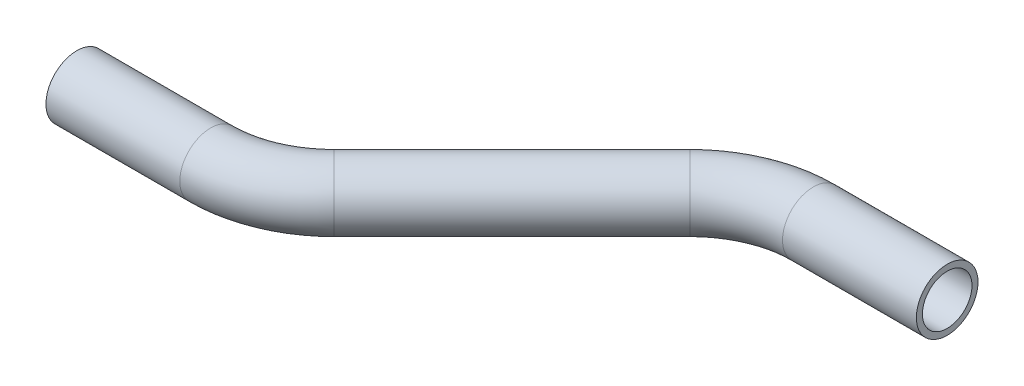
ISO-10303-21;
HEADER;
FILE_DESCRIPTION(('STEP AP214'),'2;1');
FILE_NAME('part.step','',(''),(''),'','','');
FILE_SCHEMA(('AUTOMOTIVE_DESIGN { 1 0 10303 214 1 1 1 1 }'));
ENDSEC;
DATA;
#1=APPLICATION_CONTEXT('core data for automotive mechanical design processes');
#2=APPLICATION_PROTOCOL_DEFINITION('international standard','automotive_design',2000,#1);
#3=PRODUCT_CONTEXT('',#1,'mechanical');
#4=PRODUCT('Part','Part','',(#3));
#5=PRODUCT_RELATED_PRODUCT_CATEGORY('part','',(#4));
#6=PRODUCT_DEFINITION_FORMATION('','',#4);
#7=PRODUCT_DEFINITION_CONTEXT('part definition',#1,'design');
#8=PRODUCT_DEFINITION('design','',#6,#7);
#9=PRODUCT_DEFINITION_SHAPE('','',#8);
#10=(LENGTH_UNIT() NAMED_UNIT(*) SI_UNIT(.MILLI.,.METRE.));
#11=(NAMED_UNIT(*) PLANE_ANGLE_UNIT() SI_UNIT($,.RADIAN.));
#12=(NAMED_UNIT(*) SI_UNIT($,.STERADIAN.) SOLID_ANGLE_UNIT());
#13=UNCERTAINTY_MEASURE_WITH_UNIT(LENGTH_MEASURE(1.E-05),#10,'distance_accuracy_value','');
#14=(GEOMETRIC_REPRESENTATION_CONTEXT(3) GLOBAL_UNCERTAINTY_ASSIGNED_CONTEXT((#13)) GLOBAL_UNIT_ASSIGNED_CONTEXT((#10,
#11,#12)) REPRESENTATION_CONTEXT('',''));
#15=CARTESIAN_POINT('',(0.,0.,0.));
#16=DIRECTION('',(0.,0.,1.));
#17=DIRECTION('',(1.,0.,0.));
#18=AXIS2_PLACEMENT_3D('',#15,#16,#17);
#19=CARTESIAN_POINT('',(0.,0.,0.));
#20=DIRECTION('',(1.,0.,0.));
#21=DIRECTION('',(0.,0.,-1.));
#22=AXIS2_PLACEMENT_3D('',#19,#20,#21);
#23=CYLINDRICAL_SURFACE('',#22,6.35);
#24=CARTESIAN_POINT('',(27.5789755157234,0.,0.));
#25=DIRECTION('',(1.,0.,0.));
#26=DIRECTION('',(0.,0.,-1.));
#27=AXIS2_PLACEMENT_3D('',#24,#25,#26);
#28=CIRCLE('',#27,6.35);
#29=CARTESIAN_POINT('',(27.5789755157234,0.,6.34999999999999));
#30=VERTEX_POINT('',#29);
#31=EDGE_CURVE('E61',#30,#30,#28,.T.);
#32=ORIENTED_EDGE('',*,*,#31,.F.);
#33=EDGE_LOOP('',(#32));
#34=FACE_BOUND('',#33,.T.);
#35=CARTESIAN_POINT('',(0.,0.,0.));
#36=DIRECTION('',(1.,0.,0.));
#37=DIRECTION('',(0.,0.,-1.));
#38=AXIS2_PLACEMENT_3D('',#35,#36,#37);
#39=CIRCLE('',#38,6.35);
#40=CARTESIAN_POINT('',(0.,0.,-6.35));
#41=VERTEX_POINT('',#40);
#42=EDGE_CURVE('E58',#41,#41,#39,.T.);
#43=ORIENTED_EDGE('',*,*,#42,.T.);
#44=EDGE_LOOP('',(#43));
#45=FACE_BOUND('',#44,.T.);
#46=ADVANCED_FACE('F37',(#34,#45),#23,.T.);
#47=CARTESIAN_POINT('',(27.5789755157234,0.,-25.4));
#48=DIRECTION('',(0.,1.,0.));
#49=DIRECTION('',(0.,0.,1.));
#50=AXIS2_PLACEMENT_3D('',#47,#48,#49);
#51=TOROIDAL_SURFACE('',#50,25.4,6.35);
#52=CARTESIAN_POINT('',(45.5394877578617,0.,-7.43948775786173));
#53=DIRECTION('',(0.707106781186546,0.,-0.707106781186549));
#54=DIRECTION('',(-0.707106781186549,0.,-0.707106781186546));
#55=AXIS2_PLACEMENT_3D('',#52,#53,#54);
#56=CIRCLE('',#55,6.35);
#57=CARTESIAN_POINT('',(50.0296158183963,0.,-2.94935969732716));
#58=VERTEX_POINT('',#57);
#59=EDGE_CURVE('E64',#58,#58,#56,.T.);
#60=CARTESIAN_POINT('',(27.5789755157234,0.,-25.4));
#61=DIRECTION('',(0.,1.,0.));
#62=DIRECTION('',(0.,0.,1.));
#63=AXIS2_PLACEMENT_3D('',#60,#61,#62);
#64=CIRCLE('',#63,31.75);
#65=EDGE_CURVE('',#30,#58,#64,.T.);
#66=ORIENTED_EDGE('',*,*,#31,.T.);
#67=ORIENTED_EDGE('',*,*,#59,.F.);
#68=ORIENTED_EDGE('',*,*,#65,.T.);
#69=ORIENTED_EDGE('',*,*,#65,.F.);
#70=EDGE_LOOP('',(#66,#68,#67,#69));
#71=FACE_BOUND('',#70,.T.);
#72=ADVANCED_FACE('F83',(#71),#51,.T.);
#73=CARTESIAN_POINT('',(45.5394877578617,0.,-7.43948775786173));
#74=DIRECTION('',(0.707106781186546,0.,-0.707106781186548));
#75=DIRECTION('',(-0.707106781186549,0.,-0.707106781186547));
#76=AXIS2_PLACEMENT_3D('',#73,#74,#75);
#77=CYLINDRICAL_SURFACE('',#76,6.35);
#78=CARTESIAN_POINT('',(82.2225122421381,0.,-44.1225122421382));
#79=DIRECTION('',(0.707106781186547,0.,-0.707106781186549));
#80=DIRECTION('',(-0.707106781186549,0.,-0.707106781186547));
#81=AXIS2_PLACEMENT_3D('',#78,#79,#80);
#82=CIRCLE('',#81,6.35);
#83=CARTESIAN_POINT('',(77.7323841816035,0.,-48.6126403026728));
#84=VERTEX_POINT('',#83);
#85=EDGE_CURVE('E66',#84,#84,#82,.T.);
#86=ORIENTED_EDGE('',*,*,#85,.F.);
#87=EDGE_LOOP('',(#86));
#88=FACE_BOUND('',#87,.T.);
#89=ORIENTED_EDGE('',*,*,#59,.T.);
#90=EDGE_LOOP('',(#89));
#91=FACE_BOUND('',#90,.T.);
#92=ADVANCED_FACE('F76',(#88,#91),#77,.T.);
#93=CARTESIAN_POINT('',(100.183024484276,0.,-26.162));
#94=DIRECTION('',(0.,-1.,0.));
#95=DIRECTION('',(0.,0.,-1.));
#96=AXIS2_PLACEMENT_3D('',#93,#94,#95);
#97=TOROIDAL_SURFACE('',#96,25.4,6.35);
#98=CARTESIAN_POINT('',(100.183024484276,0.,-51.562));
#99=DIRECTION('',(1.,0.,0.));
#100=DIRECTION('',(0.,0.,-1.));
#101=AXIS2_PLACEMENT_3D('',#98,#99,#100);
#102=CIRCLE('',#101,6.35);
#103=CARTESIAN_POINT('',(100.183024484276,0.,-57.912));
#104=VERTEX_POINT('',#103);
#105=EDGE_CURVE('E41',#104,#104,#102,.T.);
#106=CARTESIAN_POINT('',(100.183024484276,0.,-26.162));
#107=DIRECTION('',(0.,-1.,0.));
#108=DIRECTION('',(0.,0.,-1.));
#109=AXIS2_PLACEMENT_3D('',#106,#107,#108);
#110=CIRCLE('',#109,31.75);
#111=EDGE_CURVE('',#84,#104,#110,.T.);
#112=ORIENTED_EDGE('',*,*,#85,.T.);
#113=ORIENTED_EDGE('',*,*,#105,.F.);
#114=ORIENTED_EDGE('',*,*,#111,.T.);
#115=ORIENTED_EDGE('',*,*,#111,.F.);
#116=EDGE_LOOP('',(#112,#114,#113,#115));
#117=FACE_BOUND('',#116,.T.);
#118=ADVANCED_FACE('F74',(#117),#97,.T.);
#119=CARTESIAN_POINT('',(100.183024484276,0.,-51.562));
#120=DIRECTION('',(1.,0.,0.));
#121=DIRECTION('',(0.,0.,-1.));
#122=AXIS2_PLACEMENT_3D('',#119,#120,#121);
#123=CYLINDRICAL_SURFACE('',#122,6.35);
#124=CARTESIAN_POINT('',(127.762,0.,-51.562));
#125=DIRECTION('',(1.,0.,0.));
#126=DIRECTION('',(0.,0.,-1.));
#127=AXIS2_PLACEMENT_3D('',#124,#125,#126);
#128=CIRCLE('',#127,6.35);
#129=CARTESIAN_POINT('',(127.762,0.,-57.912));
#130=VERTEX_POINT('',#129);
#131=EDGE_CURVE('E54',#130,#130,#128,.T.);
#132=ORIENTED_EDGE('',*,*,#131,.F.);
#133=EDGE_LOOP('',(#132));
#134=FACE_BOUND('',#133,.T.);
#135=ORIENTED_EDGE('',*,*,#105,.T.);
#136=EDGE_LOOP('',(#135));
#137=FACE_BOUND('',#136,.T.);
#138=ADVANCED_FACE('F39',(#134,#137),#123,.T.);
#139=CARTESIAN_POINT('',(0.,0.,0.));
#140=DIRECTION('',(1.,0.,0.));
#141=DIRECTION('',(0.,0.,-1.));
#142=AXIS2_PLACEMENT_3D('',#139,#140,#141);
#143=PLANE('',#142);
#144=CARTESIAN_POINT('',(0.,0.,0.));
#145=DIRECTION('',(1.,0.,0.));
#146=DIRECTION('',(0.,0.,-1.));
#147=AXIS2_PLACEMENT_3D('',#144,#145,#146);
#148=CIRCLE('',#147,5.1054);
#149=CARTESIAN_POINT('',(0.,0.,-5.1054));
#150=VERTEX_POINT('',#149);
#151=EDGE_CURVE('E57',#150,#150,#148,.F.);
#152=ORIENTED_EDGE('',*,*,#151,.F.);
#153=EDGE_LOOP('',(#152));
#154=FACE_BOUND('',#153,.T.);
#155=ORIENTED_EDGE('',*,*,#42,.F.);
#156=EDGE_LOOP('',(#155));
#157=FACE_BOUND('',#156,.T.);
#158=ADVANCED_FACE('F81',(#154,#157),#143,.F.);
#159=CARTESIAN_POINT('',(127.762,0.,-51.562));
#160=DIRECTION('',(1.,0.,0.));
#161=DIRECTION('',(0.,0.,-1.));
#162=AXIS2_PLACEMENT_3D('',#159,#160,#161);
#163=PLANE('',#162);
#164=CARTESIAN_POINT('',(127.762,0.,-51.562));
#165=DIRECTION('',(1.,0.,0.));
#166=DIRECTION('',(0.,0.,-1.));
#167=AXIS2_PLACEMENT_3D('',#164,#165,#166);
#168=CIRCLE('',#167,5.1054);
#169=CARTESIAN_POINT('',(127.762,0.,-56.6674));
#170=VERTEX_POINT('',#169);
#171=EDGE_CURVE('E10',#170,#170,#168,.F.);
#172=ORIENTED_EDGE('',*,*,#171,.T.);
#173=EDGE_LOOP('',(#172));
#174=FACE_BOUND('',#173,.T.);
#175=ORIENTED_EDGE('',*,*,#131,.T.);
#176=EDGE_LOOP('',(#175));
#177=FACE_BOUND('',#176,.T.);
#178=ADVANCED_FACE('F100',(#174,#177),#163,.T.);
#179=CARTESIAN_POINT('',(0.,0.,0.));
#180=DIRECTION('',(1.,0.,0.));
#181=DIRECTION('',(0.,0.,-1.));
#182=AXIS2_PLACEMENT_3D('',#179,#180,#181);
#183=CYLINDRICAL_SURFACE('',#182,5.1054);
#184=CARTESIAN_POINT('',(27.5789755157234,0.,0.));
#185=DIRECTION('',(1.,0.,0.));
#186=DIRECTION('',(0.,0.,-1.));
#187=AXIS2_PLACEMENT_3D('',#184,#185,#186);
#188=CIRCLE('',#187,5.1054);
#189=CARTESIAN_POINT('',(27.5789755157234,0.,5.1054));
#190=VERTEX_POINT('',#189);
#191=EDGE_CURVE('E197',#190,#190,#188,.F.);
#192=ORIENTED_EDGE('',*,*,#191,.F.);
#193=EDGE_LOOP('',(#192));
#194=FACE_BOUND('',#193,.T.);
#195=ORIENTED_EDGE('',*,*,#151,.T.);
#196=EDGE_LOOP('',(#195));
#197=FACE_BOUND('',#196,.T.);
#198=ADVANCED_FACE('F103',(#194,#197),#183,.F.);
#199=CARTESIAN_POINT('',(27.5789755157234,0.,-25.4));
#200=DIRECTION('',(0.,1.,0.));
#201=DIRECTION('',(0.,0.,1.));
#202=AXIS2_PLACEMENT_3D('',#199,#200,#201);
#203=TOROIDAL_SURFACE('',#202,25.4,5.1054);
#204=CARTESIAN_POINT('',(45.5394877578617,0.,-7.43948775786173));
#205=DIRECTION('',(0.707106781186546,0.,-0.707106781186549));
#206=DIRECTION('',(-0.707106781186549,0.,-0.707106781186546));
#207=AXIS2_PLACEMENT_3D('',#204,#205,#206);
#208=CIRCLE('',#207,5.1054);
#209=CARTESIAN_POINT('',(49.1495507185315,0.,-3.82942479719193));
#210=VERTEX_POINT('',#209);
#211=EDGE_CURVE('E196',#210,#210,#208,.F.);
#212=CARTESIAN_POINT('',(27.5789755157234,0.,-25.4));
#213=DIRECTION('',(0.,1.,0.));
#214=DIRECTION('',(0.,0.,1.));
#215=AXIS2_PLACEMENT_3D('',#212,#213,#214);
#216=CIRCLE('',#215,30.5054);
#217=EDGE_CURVE('',#190,#210,#216,.T.);
#218=ORIENTED_EDGE('',*,*,#191,.T.);
#219=ORIENTED_EDGE('',*,*,#211,.F.);
#220=ORIENTED_EDGE('',*,*,#217,.T.);
#221=ORIENTED_EDGE('',*,*,#217,.F.);
#222=EDGE_LOOP('',(#218,#220,#219,#221));
#223=FACE_BOUND('',#222,.T.);
#224=ADVANCED_FACE('F159',(#223),#203,.F.);
#225=CARTESIAN_POINT('',(45.5394877578617,0.,-7.43948775786173));
#226=DIRECTION('',(0.707106781186546,0.,-0.707106781186548));
#227=DIRECTION('',(-0.707106781186549,0.,-0.707106781186547));
#228=AXIS2_PLACEMENT_3D('',#225,#226,#227);
#229=CYLINDRICAL_SURFACE('',#228,5.1054);
#230=CARTESIAN_POINT('',(82.2225122421381,0.,-44.1225122421382));
#231=DIRECTION('',(0.707106781186547,0.,-0.707106781186549));
#232=DIRECTION('',(-0.707106781186549,0.,-0.707106781186547));
#233=AXIS2_PLACEMENT_3D('',#230,#231,#232);
#234=CIRCLE('',#233,5.1054);
#235=CARTESIAN_POINT('',(78.6124492814683,0.,-47.7325752028081));
#236=VERTEX_POINT('',#235);
#237=EDGE_CURVE('E50',#236,#236,#234,.F.);
#238=ORIENTED_EDGE('',*,*,#237,.F.);
#239=EDGE_LOOP('',(#238));
#240=FACE_BOUND('',#239,.T.);
#241=ORIENTED_EDGE('',*,*,#211,.T.);
#242=EDGE_LOOP('',(#241));
#243=FACE_BOUND('',#242,.T.);
#244=ADVANCED_FACE('F94',(#240,#243),#229,.F.);
#245=CARTESIAN_POINT('',(100.183024484276,0.,-26.162));
#246=DIRECTION('',(0.,-1.,0.));
#247=DIRECTION('',(0.,0.,-1.));
#248=AXIS2_PLACEMENT_3D('',#245,#246,#247);
#249=TOROIDAL_SURFACE('',#248,25.4,5.1054);
#250=CARTESIAN_POINT('',(100.183024484276,0.,-51.562));
#251=DIRECTION('',(1.,0.,0.));
#252=DIRECTION('',(0.,0.,-1.));
#253=AXIS2_PLACEMENT_3D('',#250,#251,#252);
#254=CIRCLE('',#253,5.1054);
#255=CARTESIAN_POINT('',(100.183024484276,0.,-56.6674));
#256=VERTEX_POINT('',#255);
#257=EDGE_CURVE('E45',#256,#256,#254,.F.);
#258=CARTESIAN_POINT('',(100.183024484276,0.,-26.162));
#259=DIRECTION('',(0.,-1.,0.));
#260=DIRECTION('',(0.,0.,-1.));
#261=AXIS2_PLACEMENT_3D('',#258,#259,#260);
#262=CIRCLE('',#261,30.5054);
#263=EDGE_CURVE('',#236,#256,#262,.T.);
#264=ORIENTED_EDGE('',*,*,#237,.T.);
#265=ORIENTED_EDGE('',*,*,#257,.F.);
#266=ORIENTED_EDGE('',*,*,#263,.T.);
#267=ORIENTED_EDGE('',*,*,#263,.F.);
#268=EDGE_LOOP('',(#264,#266,#265,#267));
#269=FACE_BOUND('',#268,.T.);
#270=ADVANCED_FACE('F88',(#269),#249,.F.);
#271=CARTESIAN_POINT('',(100.183024484276,0.,-51.562));
#272=DIRECTION('',(1.,0.,0.));
#273=DIRECTION('',(0.,0.,-1.));
#274=AXIS2_PLACEMENT_3D('',#271,#272,#273);
#275=CYLINDRICAL_SURFACE('',#274,5.1054);
#276=ORIENTED_EDGE('',*,*,#171,.F.);
#277=EDGE_LOOP('',(#276));
#278=FACE_BOUND('',#277,.T.);
#279=ORIENTED_EDGE('',*,*,#257,.T.);
#280=EDGE_LOOP('',(#279));
#281=FACE_BOUND('',#280,.T.);
#282=ADVANCED_FACE('F86',(#278,#281),#275,.F.);
#283=CLOSED_SHELL('',(#46,#72,#92,#118,#138,#158,#178,#198,#224,#244,#270,#282));
#284=MANIFOLD_SOLID_BREP('B2',#283);
#285=ADVANCED_BREP_SHAPE_REPRESENTATION('',(#18,#284),#14);
#286=SHAPE_DEFINITION_REPRESENTATION(#9,#285);
ENDSEC;
END-ISO-10303-21;
